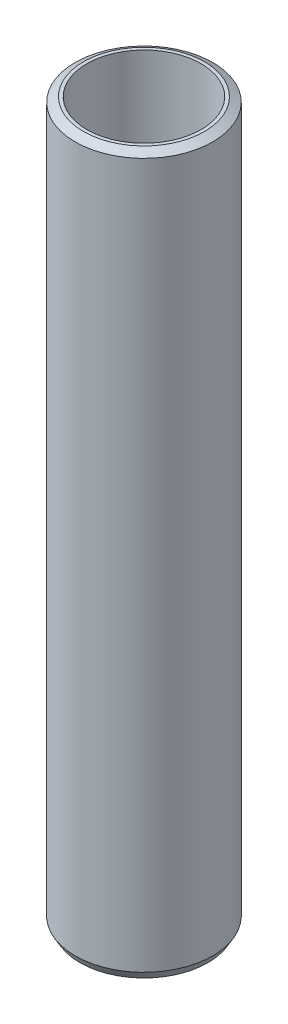
ISO-10303-21;
HEADER;
FILE_DESCRIPTION(('STEP AP214'),'2;1');
FILE_NAME('part.step','',(''),(''),'','','');
FILE_SCHEMA(('AUTOMOTIVE_DESIGN { 1 0 10303 214 1 1 1 1 }'));
ENDSEC;
DATA;
#1=APPLICATION_CONTEXT('core data for automotive mechanical design processes');
#2=APPLICATION_PROTOCOL_DEFINITION('international standard','automotive_design',2000,#1);
#3=PRODUCT_CONTEXT('',#1,'mechanical');
#4=PRODUCT('Part','Part','',(#3));
#5=PRODUCT_RELATED_PRODUCT_CATEGORY('part','',(#4));
#6=PRODUCT_DEFINITION_FORMATION('','',#4);
#7=PRODUCT_DEFINITION_CONTEXT('part definition',#1,'design');
#8=PRODUCT_DEFINITION('design','',#6,#7);
#9=PRODUCT_DEFINITION_SHAPE('','',#8);
#10=(LENGTH_UNIT() NAMED_UNIT(*) SI_UNIT(.MILLI.,.METRE.));
#11=(NAMED_UNIT(*) PLANE_ANGLE_UNIT() SI_UNIT($,.RADIAN.));
#12=(NAMED_UNIT(*) SI_UNIT($,.STERADIAN.) SOLID_ANGLE_UNIT());
#13=UNCERTAINTY_MEASURE_WITH_UNIT(LENGTH_MEASURE(1.E-05),#10,'distance_accuracy_value','');
#14=(GEOMETRIC_REPRESENTATION_CONTEXT(3) GLOBAL_UNCERTAINTY_ASSIGNED_CONTEXT((#13)) GLOBAL_UNIT_ASSIGNED_CONTEXT((#10,
#11,#12)) REPRESENTATION_CONTEXT('',''));
#15=CARTESIAN_POINT('',(0.,0.,0.));
#16=DIRECTION('',(0.,0.,1.));
#17=DIRECTION('',(1.,0.,0.));
#18=AXIS2_PLACEMENT_3D('',#15,#16,#17);
#19=CARTESIAN_POINT('',(0.,600.,0.));
#20=DIRECTION('',(0.,-1.,0.));
#21=DIRECTION('',(0.,0.,-1.));
#22=AXIS2_PLACEMENT_3D('',#19,#20,#21);
#23=CYLINDRICAL_SURFACE('',#22,57.5);
#24=CARTESIAN_POINT('',(0.,595.976150816459,0.));
#25=DIRECTION('',(0.,1.,0.));
#26=DIRECTION('',(0.,0.,1.));
#27=AXIS2_PLACEMENT_3D('',#24,#25,#26);
#28=CIRCLE('',#27,57.5);
#29=CARTESIAN_POINT('',(0.,595.976150816459,57.5));
#30=VERTEX_POINT('',#29);
#31=EDGE_CURVE('E50',#30,#30,#28,.F.);
#32=ORIENTED_EDGE('',*,*,#31,.T.);
#33=EDGE_LOOP('',(#32));
#34=FACE_BOUND('',#33,.T.);
#35=CARTESIAN_POINT('',(0.,6.96951122788769,0.));
#36=DIRECTION('',(0.,1.,0.));
#37=DIRECTION('',(0.,0.,1.));
#38=AXIS2_PLACEMENT_3D('',#35,#36,#37);
#39=CIRCLE('',#38,57.5);
#40=CARTESIAN_POINT('',(0.,6.96951122788769,57.5));
#41=VERTEX_POINT('',#40);
#42=EDGE_CURVE('E51',#41,#41,#39,.T.);
#43=ORIENTED_EDGE('',*,*,#42,.T.);
#44=EDGE_LOOP('',(#43));
#45=FACE_BOUND('',#44,.T.);
#46=ADVANCED_FACE('F39',(#34,#45),#23,.T.);
#47=CARTESIAN_POINT('',(0.,600.,0.));
#48=DIRECTION('',(0.,1.,0.));
#49=DIRECTION('',(0.,0.,1.));
#50=AXIS2_PLACEMENT_3D('',#47,#48,#49);
#51=PLANE('',#50);
#52=CARTESIAN_POINT('',(0.,600.,0.));
#53=DIRECTION('',(0.,1.,0.));
#54=DIRECTION('',(0.,0.,1.));
#55=AXIS2_PLACEMENT_3D('',#52,#53,#54);
#56=CIRCLE('',#55,50.5304887721122);
#57=CARTESIAN_POINT('',(0.,600.,50.5304887721122));
#58=VERTEX_POINT('',#57);
#59=EDGE_CURVE('E54',#58,#58,#56,.T.);
#60=ORIENTED_EDGE('',*,*,#59,.T.);
#61=EDGE_LOOP('',(#60));
#62=FACE_BOUND('',#61,.T.);
#63=CARTESIAN_POINT('',(0.,600.,0.));
#64=DIRECTION('',(0.,1.,0.));
#65=DIRECTION('',(0.,0.,1.));
#66=AXIS2_PLACEMENT_3D('',#63,#64,#65);
#67=CIRCLE('',#66,47.7489939125634);
#68=CARTESIAN_POINT('',(0.,600.,47.7489939125634));
#69=VERTEX_POINT('',#68);
#70=EDGE_CURVE('E58',#69,#69,#67,.T.);
#71=ORIENTED_EDGE('',*,*,#70,.F.);
#72=EDGE_LOOP('',(#71));
#73=FACE_BOUND('',#72,.T.);
#74=ADVANCED_FACE('F69',(#62,#73),#51,.T.);
#75=CARTESIAN_POINT('',(0.,0.,0.));
#76=DIRECTION('',(0.,1.,0.));
#77=DIRECTION('',(0.,0.,1.));
#78=AXIS2_PLACEMENT_3D('',#75,#76,#77);
#79=PLANE('',#78);
#80=CARTESIAN_POINT('',(0.,0.,0.));
#81=DIRECTION('',(0.,1.,0.));
#82=DIRECTION('',(0.,0.,1.));
#83=AXIS2_PLACEMENT_3D('',#80,#81,#82);
#84=CIRCLE('',#83,53.4761508164589);
#85=CARTESIAN_POINT('',(0.,0.,53.4761508164589));
#86=VERTEX_POINT('',#85);
#87=EDGE_CURVE('E10',#86,#86,#84,.F.);
#88=ORIENTED_EDGE('',*,*,#87,.T.);
#89=EDGE_LOOP('',(#88));
#90=FACE_BOUND('',#89,.T.);
#91=CARTESIAN_POINT('',(0.,0.,0.));
#92=DIRECTION('',(0.,1.,0.));
#93=DIRECTION('',(0.,0.,1.));
#94=AXIS2_PLACEMENT_3D('',#91,#92,#93);
#95=CIRCLE('',#94,47.7489939125634);
#96=CARTESIAN_POINT('',(0.,0.,47.7489939125634));
#97=VERTEX_POINT('',#96);
#98=EDGE_CURVE('E63',#97,#97,#95,.T.);
#99=ORIENTED_EDGE('',*,*,#98,.T.);
#100=EDGE_LOOP('',(#99));
#101=FACE_BOUND('',#100,.T.);
#102=ADVANCED_FACE('F75',(#90,#101),#79,.F.);
#103=CARTESIAN_POINT('',(0.,600.,0.));
#104=DIRECTION('',(0.,-1.,0.));
#105=DIRECTION('',(0.,0.,-1.));
#106=AXIS2_PLACEMENT_3D('',#103,#104,#105);
#107=CYLINDRICAL_SURFACE('',#106,47.7489939125634);
#108=ORIENTED_EDGE('',*,*,#70,.T.);
#109=EDGE_LOOP('',(#108));
#110=FACE_BOUND('',#109,.T.);
#111=ORIENTED_EDGE('',*,*,#98,.F.);
#112=EDGE_LOOP('',(#111));
#113=FACE_BOUND('',#112,.T.);
#114=ADVANCED_FACE('F70',(#110,#113),#107,.F.);
#115=CARTESIAN_POINT('',(0.,600.,0.));
#116=DIRECTION('',(0.,-1.,0.));
#117=DIRECTION('',(0.,0.,-1.));
#118=AXIS2_PLACEMENT_3D('',#115,#116,#117);
#119=CONICAL_SURFACE('',#118,50.5304887721122,1.0471975511966);
#120=ORIENTED_EDGE('',*,*,#31,.F.);
#121=EDGE_LOOP('',(#120));
#122=FACE_BOUND('',#121,.T.);
#123=ORIENTED_EDGE('',*,*,#59,.F.);
#124=EDGE_LOOP('',(#123));
#125=FACE_BOUND('',#124,.T.);
#126=ADVANCED_FACE('F81',(#122,#125),#119,.T.);
#127=CARTESIAN_POINT('',(0.,6.96951122788769,0.));
#128=DIRECTION('',(0.,1.,0.));
#129=DIRECTION('',(0.,0.,1.));
#130=AXIS2_PLACEMENT_3D('',#127,#128,#129);
#131=CONICAL_SURFACE('',#130,57.5,0.523598775598301);
#132=ORIENTED_EDGE('',*,*,#87,.F.);
#133=EDGE_LOOP('',(#132));
#134=FACE_BOUND('',#133,.T.);
#135=ORIENTED_EDGE('',*,*,#42,.F.);
#136=EDGE_LOOP('',(#135));
#137=FACE_BOUND('',#136,.T.);
#138=ADVANCED_FACE('F45',(#134,#137),#131,.T.);
#139=CLOSED_SHELL('',(#46,#74,#102,#114,#126,#138));
#140=MANIFOLD_SOLID_BREP('B2',#139);
#141=ADVANCED_BREP_SHAPE_REPRESENTATION('',(#18,#140),#14);
#142=SHAPE_DEFINITION_REPRESENTATION(#9,#141);
ENDSEC;
END-ISO-10303-21;
